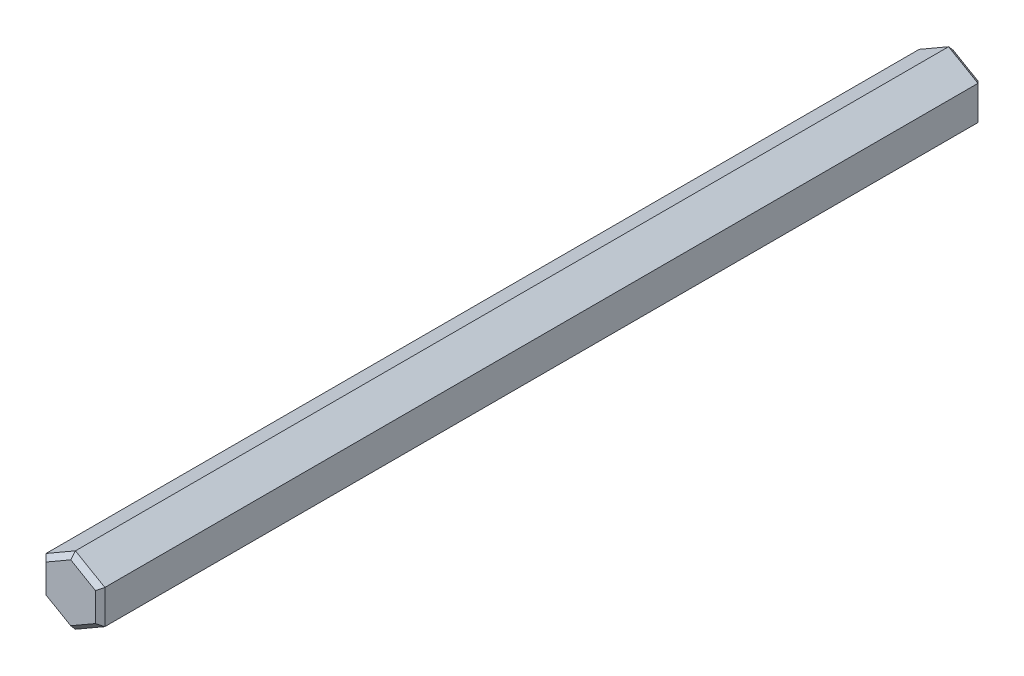
ISO-10303-21;
HEADER;
FILE_DESCRIPTION(('STEP AP214'),'2;1');
FILE_NAME('part.step','',(''),(''),'','','');
FILE_SCHEMA(('AUTOMOTIVE_DESIGN { 1 0 10303 214 1 1 1 1 }'));
ENDSEC;
DATA;
#1=APPLICATION_CONTEXT('core data for automotive mechanical design processes');
#2=APPLICATION_PROTOCOL_DEFINITION('international standard','automotive_design',2000,#1);
#3=PRODUCT_CONTEXT('',#1,'mechanical');
#4=PRODUCT('Part','Part','',(#3));
#5=PRODUCT_RELATED_PRODUCT_CATEGORY('part','',(#4));
#6=PRODUCT_DEFINITION_FORMATION('','',#4);
#7=PRODUCT_DEFINITION_CONTEXT('part definition',#1,'design');
#8=PRODUCT_DEFINITION('design','',#6,#7);
#9=PRODUCT_DEFINITION_SHAPE('','',#8);
#10=(LENGTH_UNIT() NAMED_UNIT(*) SI_UNIT(.MILLI.,.METRE.));
#11=(NAMED_UNIT(*) PLANE_ANGLE_UNIT() SI_UNIT($,.RADIAN.));
#12=(NAMED_UNIT(*) SI_UNIT($,.STERADIAN.) SOLID_ANGLE_UNIT());
#13=UNCERTAINTY_MEASURE_WITH_UNIT(LENGTH_MEASURE(1.E-05),#10,'distance_accuracy_value','');
#14=(GEOMETRIC_REPRESENTATION_CONTEXT(3) GLOBAL_UNCERTAINTY_ASSIGNED_CONTEXT((#13)) GLOBAL_UNIT_ASSIGNED_CONTEXT((#10,
#11,#12)) REPRESENTATION_CONTEXT('',''));
#15=CARTESIAN_POINT('',(0.,0.,0.));
#16=DIRECTION('',(0.,0.,1.));
#17=DIRECTION('',(1.,0.,0.));
#18=AXIS2_PLACEMENT_3D('',#15,#16,#17);
#19=CARTESIAN_POINT('',(-2.5,-1.44337567297406,0.));
#20=DIRECTION('',(-0.5,-0.866025403784439,0.));
#21=DIRECTION('',(0.866025403784439,-0.5,0.));
#22=AXIS2_PLACEMENT_3D('',#19,#20,#21);
#23=PLANE('',#22);
#24=DIRECTION('',(0.,0.,1.));
#25=VECTOR('',#24,1.);
#26=CARTESIAN_POINT('',(-2.5,-1.44337567297406,0.));
#27=LINE('',#26,#25);
#28=CARTESIAN_POINT('',(-2.5,-1.44337567297406,0.399999999999984));
#29=VERTEX_POINT('',#28);
#30=CARTESIAN_POINT('',(-2.5,-1.44337567297406,74.6));
#31=VERTEX_POINT('',#30);
#32=EDGE_CURVE('E149',#29,#31,#27,.T.);
#33=ORIENTED_EDGE('',*,*,#32,.F.);
#34=DIRECTION('',(0.866025403784439,-0.5,0.));
#35=VECTOR('',#34,1.);
#36=CARTESIAN_POINT('',(0.,-2.88675134594813,0.399999999999984));
#37=LINE('',#36,#35);
#38=CARTESIAN_POINT('',(0.,-2.88675134594813,0.399999999999984));
#39=VERTEX_POINT('',#38);
#40=EDGE_CURVE('E181',#29,#39,#37,.T.);
#41=ORIENTED_EDGE('',*,*,#40,.T.);
#42=DIRECTION('',(0.,0.,1.));
#43=VECTOR('',#42,1.);
#44=CARTESIAN_POINT('',(0.,-2.88675134594813,0.));
#45=LINE('',#44,#43);
#46=CARTESIAN_POINT('',(0.,-2.88675134594813,74.6));
#47=VERTEX_POINT('',#46);
#48=EDGE_CURVE('E214',#39,#47,#45,.T.);
#49=ORIENTED_EDGE('',*,*,#48,.T.);
#50=DIRECTION('',(-0.866025403784439,0.5,0.));
#51=VECTOR('',#50,1.);
#52=CARTESIAN_POINT('',(-2.5,-1.44337567297406,74.6));
#53=LINE('',#52,#51);
#54=EDGE_CURVE('E179',#47,#31,#53,.T.);
#55=ORIENTED_EDGE('',*,*,#54,.T.);
#56=EDGE_LOOP('',(#33,#41,#49,#55));
#57=FACE_BOUND('',#56,.T.);
#58=ADVANCED_FACE('F32',(#57),#23,.T.);
#59=CARTESIAN_POINT('',(-2.5,1.44337567297407,0.));
#60=DIRECTION('',(-1.,0.,0.));
#61=DIRECTION('',(0.,0.,1.));
#62=AXIS2_PLACEMENT_3D('',#59,#60,#61);
#63=PLANE('',#62);
#64=DIRECTION('',(0.,0.,1.));
#65=VECTOR('',#64,1.);
#66=CARTESIAN_POINT('',(-2.5,1.44337567297407,0.));
#67=LINE('',#66,#65);
#68=CARTESIAN_POINT('',(-2.5,1.44337567297407,0.399999999999984));
#69=VERTEX_POINT('',#68);
#70=CARTESIAN_POINT('',(-2.5,1.44337567297407,74.6));
#71=VERTEX_POINT('',#70);
#72=EDGE_CURVE('E130',#69,#71,#67,.T.);
#73=ORIENTED_EDGE('',*,*,#72,.F.);
#74=DIRECTION('',(0.,-1.,0.));
#75=VECTOR('',#74,1.);
#76=CARTESIAN_POINT('',(-2.5,-1.44337567297406,0.399999999999984));
#77=LINE('',#76,#75);
#78=EDGE_CURVE('E145',#69,#29,#77,.T.);
#79=ORIENTED_EDGE('',*,*,#78,.T.);
#80=ORIENTED_EDGE('',*,*,#32,.T.);
#81=DIRECTION('',(0.,1.,0.));
#82=VECTOR('',#81,1.);
#83=CARTESIAN_POINT('',(-2.5,1.44337567297407,74.6));
#84=LINE('',#83,#82);
#85=EDGE_CURVE('E148',#31,#71,#84,.T.);
#86=ORIENTED_EDGE('',*,*,#85,.T.);
#87=EDGE_LOOP('',(#73,#79,#80,#86));
#88=FACE_BOUND('',#87,.T.);
#89=ADVANCED_FACE('F142',(#88),#63,.T.);
#90=CARTESIAN_POINT('',(0.,2.88675134594813,0.));
#91=DIRECTION('',(-0.5,0.866025403784439,0.));
#92=DIRECTION('',(-0.866025403784439,-0.5,0.));
#93=AXIS2_PLACEMENT_3D('',#90,#91,#92);
#94=PLANE('',#93);
#95=DIRECTION('',(0.,0.,1.));
#96=VECTOR('',#95,1.);
#97=CARTESIAN_POINT('',(0.,2.88675134594813,0.));
#98=LINE('',#97,#96);
#99=CARTESIAN_POINT('',(0.,2.88675134594813,0.399999999999984));
#100=VERTEX_POINT('',#99);
#101=CARTESIAN_POINT('',(0.,2.88675134594813,74.6));
#102=VERTEX_POINT('',#101);
#103=EDGE_CURVE('E132',#100,#102,#98,.T.);
#104=ORIENTED_EDGE('',*,*,#103,.F.);
#105=DIRECTION('',(-0.866025403784439,-0.5,0.));
#106=VECTOR('',#105,1.);
#107=CARTESIAN_POINT('',(-2.5,1.44337567297407,0.399999999999984));
#108=LINE('',#107,#106);
#109=EDGE_CURVE('E126',#100,#69,#108,.T.);
#110=ORIENTED_EDGE('',*,*,#109,.T.);
#111=ORIENTED_EDGE('',*,*,#72,.T.);
#112=DIRECTION('',(0.866025403784439,0.5,0.));
#113=VECTOR('',#112,1.);
#114=CARTESIAN_POINT('',(0.,2.88675134594813,74.6));
#115=LINE('',#114,#113);
#116=EDGE_CURVE('E138',#71,#102,#115,.T.);
#117=ORIENTED_EDGE('',*,*,#116,.T.);
#118=EDGE_LOOP('',(#104,#110,#111,#117));
#119=FACE_BOUND('',#118,.T.);
#120=ADVANCED_FACE('F128',(#119),#94,.T.);
#121=CARTESIAN_POINT('',(2.5,1.44337567297406,0.));
#122=DIRECTION('',(0.5,0.866025403784439,0.));
#123=DIRECTION('',(-0.866025403784439,0.5,0.));
#124=AXIS2_PLACEMENT_3D('',#121,#122,#123);
#125=PLANE('',#124);
#126=DIRECTION('',(0.,0.,1.));
#127=VECTOR('',#126,1.);
#128=CARTESIAN_POINT('',(2.5,1.44337567297406,0.));
#129=LINE('',#128,#127);
#130=CARTESIAN_POINT('',(2.5,1.44337567297406,0.399999999999984));
#131=VERTEX_POINT('',#130);
#132=CARTESIAN_POINT('',(2.5,1.44337567297406,74.6));
#133=VERTEX_POINT('',#132);
#134=EDGE_CURVE('E248',#131,#133,#129,.T.);
#135=ORIENTED_EDGE('',*,*,#134,.F.);
#136=DIRECTION('',(-0.866025403784439,0.5,0.));
#137=VECTOR('',#136,1.);
#138=CARTESIAN_POINT('',(0.,2.88675134594813,0.399999999999984));
#139=LINE('',#138,#137);
#140=EDGE_CURVE('E189',#131,#100,#139,.T.);
#141=ORIENTED_EDGE('',*,*,#140,.T.);
#142=ORIENTED_EDGE('',*,*,#103,.T.);
#143=DIRECTION('',(0.866025403784439,-0.5,0.));
#144=VECTOR('',#143,1.);
#145=CARTESIAN_POINT('',(2.5,1.44337567297406,74.6));
#146=LINE('',#145,#144);
#147=EDGE_CURVE('E187',#102,#133,#146,.T.);
#148=ORIENTED_EDGE('',*,*,#147,.T.);
#149=EDGE_LOOP('',(#135,#141,#142,#148));
#150=FACE_BOUND('',#149,.T.);
#151=ADVANCED_FACE('F265',(#150),#125,.T.);
#152=CARTESIAN_POINT('',(2.5,-1.44337567297406,0.));
#153=DIRECTION('',(1.,0.,0.));
#154=DIRECTION('',(0.,0.,-1.));
#155=AXIS2_PLACEMENT_3D('',#152,#153,#154);
#156=PLANE('',#155);
#157=DIRECTION('',(0.,0.,1.));
#158=VECTOR('',#157,1.);
#159=CARTESIAN_POINT('',(2.5,-1.44337567297406,0.));
#160=LINE('',#159,#158);
#161=CARTESIAN_POINT('',(2.5,-1.44337567297406,0.399999999999984));
#162=VERTEX_POINT('',#161);
#163=CARTESIAN_POINT('',(2.5,-1.44337567297406,74.6));
#164=VERTEX_POINT('',#163);
#165=EDGE_CURVE('E246',#162,#164,#160,.T.);
#166=ORIENTED_EDGE('',*,*,#165,.F.);
#167=DIRECTION('',(0.,1.,0.));
#168=VECTOR('',#167,1.);
#169=CARTESIAN_POINT('',(2.5,1.44337567297406,0.399999999999984));
#170=LINE('',#169,#168);
#171=EDGE_CURVE('E193',#162,#131,#170,.T.);
#172=ORIENTED_EDGE('',*,*,#171,.T.);
#173=ORIENTED_EDGE('',*,*,#134,.T.);
#174=DIRECTION('',(0.,-1.,0.));
#175=VECTOR('',#174,1.);
#176=CARTESIAN_POINT('',(2.5,-1.44337567297406,74.6));
#177=LINE('',#176,#175);
#178=EDGE_CURVE('E191',#133,#164,#177,.T.);
#179=ORIENTED_EDGE('',*,*,#178,.T.);
#180=EDGE_LOOP('',(#166,#172,#173,#179));
#181=FACE_BOUND('',#180,.T.);
#182=ADVANCED_FACE('F302',(#181),#156,.T.);
#183=CARTESIAN_POINT('',(0.,-2.88675134594813,0.));
#184=DIRECTION('',(0.5,-0.866025403784439,0.));
#185=DIRECTION('',(0.866025403784439,0.5,0.));
#186=AXIS2_PLACEMENT_3D('',#183,#184,#185);
#187=PLANE('',#186);
#188=ORIENTED_EDGE('',*,*,#48,.F.);
#189=DIRECTION('',(0.866025403784439,0.5,0.));
#190=VECTOR('',#189,1.);
#191=CARTESIAN_POINT('',(2.5,-1.44337567297406,0.399999999999984));
#192=LINE('',#191,#190);
#193=EDGE_CURVE('E185',#39,#162,#192,.T.);
#194=ORIENTED_EDGE('',*,*,#193,.T.);
#195=ORIENTED_EDGE('',*,*,#165,.T.);
#196=DIRECTION('',(-0.866025403784439,-0.5,0.));
#197=VECTOR('',#196,1.);
#198=CARTESIAN_POINT('',(0.,-2.88675134594813,74.6));
#199=LINE('',#198,#197);
#200=EDGE_CURVE('E137',#164,#47,#199,.T.);
#201=ORIENTED_EDGE('',*,*,#200,.T.);
#202=EDGE_LOOP('',(#188,#194,#195,#201));
#203=FACE_BOUND('',#202,.T.);
#204=ADVANCED_FACE('F243',(#203),#187,.T.);
#205=CARTESIAN_POINT('',(0.,0.,0.));
#206=DIRECTION('',(0.,0.,1.));
#207=DIRECTION('',(1.,0.,0.));
#208=AXIS2_PLACEMENT_3D('',#205,#206,#207);
#209=PLANE('',#208);
#210=DIRECTION('',(-0.866025403784439,0.5,0.));
#211=VECTOR('',#210,1.);
#212=CARTESIAN_POINT('',(-2.3,-1.09696551146029,0.));
#213=LINE('',#212,#211);
#214=CARTESIAN_POINT('',(0.,-2.42487113059643,0.));
#215=VERTEX_POINT('',#214);
#216=CARTESIAN_POINT('',(-2.1,-1.21243556529822,0.));
#217=VERTEX_POINT('',#216);
#218=EDGE_CURVE('E175',#215,#217,#213,.T.);
#219=ORIENTED_EDGE('',*,*,#218,.T.);
#220=DIRECTION('',(0.,1.,0.));
#221=VECTOR('',#220,1.);
#222=CARTESIAN_POINT('',(-2.1,1.44337567297407,0.));
#223=LINE('',#222,#221);
#224=CARTESIAN_POINT('',(-2.1,1.21243556529822,0.));
#225=VERTEX_POINT('',#224);
#226=EDGE_CURVE('E177',#217,#225,#223,.T.);
#227=ORIENTED_EDGE('',*,*,#226,.T.);
#228=DIRECTION('',(0.866025403784439,0.5,0.));
#229=VECTOR('',#228,1.);
#230=CARTESIAN_POINT('',(0.199999999999997,2.54034118443435,0.));
#231=LINE('',#230,#229);
#232=CARTESIAN_POINT('',(0.,2.42487113059643,0.));
#233=VERTEX_POINT('',#232);
#234=EDGE_CURVE('E154',#225,#233,#231,.T.);
#235=ORIENTED_EDGE('',*,*,#234,.T.);
#236=DIRECTION('',(0.866025403784439,-0.5,0.));
#237=VECTOR('',#236,1.);
#238=CARTESIAN_POINT('',(2.3,1.09696551146029,0.));
#239=LINE('',#238,#237);
#240=CARTESIAN_POINT('',(2.1,1.21243556529821,0.));
#241=VERTEX_POINT('',#240);
#242=EDGE_CURVE('E166',#233,#241,#239,.T.);
#243=ORIENTED_EDGE('',*,*,#242,.T.);
#244=DIRECTION('',(0.,-1.,0.));
#245=VECTOR('',#244,1.);
#246=CARTESIAN_POINT('',(2.1,-1.44337567297406,0.));
#247=LINE('',#246,#245);
#248=CARTESIAN_POINT('',(2.1,-1.21243556529821,0.));
#249=VERTEX_POINT('',#248);
#250=EDGE_CURVE('E164',#241,#249,#247,.T.);
#251=ORIENTED_EDGE('',*,*,#250,.T.);
#252=DIRECTION('',(-0.866025403784439,-0.5,0.));
#253=VECTOR('',#252,1.);
#254=CARTESIAN_POINT('',(-0.199999999999999,-2.54034118443435,0.));
#255=LINE('',#254,#253);
#256=EDGE_CURVE('E172',#249,#215,#255,.T.);
#257=ORIENTED_EDGE('',*,*,#256,.T.);
#258=EDGE_LOOP('',(#219,#227,#235,#243,#251,#257));
#259=FACE_BOUND('',#258,.T.);
#260=ADVANCED_FACE('F273',(#259),#209,.F.);
#261=CARTESIAN_POINT('',(0.,0.,75.));
#262=DIRECTION('',(0.,0.,1.));
#263=DIRECTION('',(1.,0.,0.));
#264=AXIS2_PLACEMENT_3D('',#261,#262,#263);
#265=PLANE('',#264);
#266=DIRECTION('',(-0.866025403784439,0.5,0.));
#267=VECTOR('',#266,1.);
#268=CARTESIAN_POINT('',(1.05,1.81865334794732,75.));
#269=LINE('',#268,#267);
#270=CARTESIAN_POINT('',(2.1,1.21243556529821,75.));
#271=VERTEX_POINT('',#270);
#272=CARTESIAN_POINT('',(0.,2.42487113059643,75.));
#273=VERTEX_POINT('',#272);
#274=EDGE_CURVE('E56',#271,#273,#269,.T.);
#275=ORIENTED_EDGE('',*,*,#274,.T.);
#276=DIRECTION('',(-0.866025403784439,-0.5,0.));
#277=VECTOR('',#276,1.);
#278=CARTESIAN_POINT('',(-1.05,1.81865334794732,75.));
#279=LINE('',#278,#277);
#280=CARTESIAN_POINT('',(-2.1,1.21243556529822,75.));
#281=VERTEX_POINT('',#280);
#282=EDGE_CURVE('E11',#273,#281,#279,.T.);
#283=ORIENTED_EDGE('',*,*,#282,.T.);
#284=DIRECTION('',(0.,-1.,0.));
#285=VECTOR('',#284,1.);
#286=CARTESIAN_POINT('',(-2.1,0.,75.));
#287=LINE('',#286,#285);
#288=CARTESIAN_POINT('',(-2.1,-1.21243556529821,75.));
#289=VERTEX_POINT('',#288);
#290=EDGE_CURVE('E41',#281,#289,#287,.T.);
#291=ORIENTED_EDGE('',*,*,#290,.T.);
#292=DIRECTION('',(0.866025403784439,-0.5,0.));
#293=VECTOR('',#292,1.);
#294=CARTESIAN_POINT('',(-1.05,-1.81865334794732,75.));
#295=LINE('',#294,#293);
#296=CARTESIAN_POINT('',(0.,-2.42487113059643,75.));
#297=VERTEX_POINT('',#296);
#298=EDGE_CURVE('E199',#289,#297,#295,.T.);
#299=ORIENTED_EDGE('',*,*,#298,.T.);
#300=DIRECTION('',(0.866025403784439,0.5,0.));
#301=VECTOR('',#300,1.);
#302=CARTESIAN_POINT('',(1.05,-1.81865334794732,75.));
#303=LINE('',#302,#301);
#304=CARTESIAN_POINT('',(2.1,-1.21243556529821,75.));
#305=VERTEX_POINT('',#304);
#306=EDGE_CURVE('E195',#297,#305,#303,.T.);
#307=ORIENTED_EDGE('',*,*,#306,.T.);
#308=DIRECTION('',(0.,1.,0.));
#309=VECTOR('',#308,1.);
#310=CARTESIAN_POINT('',(2.1,0.,75.));
#311=LINE('',#310,#309);
#312=EDGE_CURVE('E197',#305,#271,#311,.T.);
#313=ORIENTED_EDGE('',*,*,#312,.T.);
#314=EDGE_LOOP('',(#275,#283,#291,#299,#307,#313));
#315=FACE_BOUND('',#314,.T.);
#316=ADVANCED_FACE('F258',(#315),#265,.T.);
#317=CARTESIAN_POINT('',(2.5,-1.44337567297406,0.399999999999984));
#318=DIRECTION('',(0.707106781186548,0.,-0.707106781186548));
#319=DIRECTION('',(0.,-1.,0.));
#320=AXIS2_PLACEMENT_3D('',#317,#318,#319);
#321=PLANE('',#320);
#322=DIRECTION('',(-0.654653670707977,0.377964473009227,-0.654653670707977));
#323=VECTOR('',#322,1.);
#324=CARTESIAN_POINT('',(2.5,-1.44337567297406,0.399999999999984));
#325=LINE('',#324,#323);
#326=EDGE_CURVE('E208',#249,#162,#325,.F.);
#327=ORIENTED_EDGE('',*,*,#326,.F.);
#328=ORIENTED_EDGE('',*,*,#250,.F.);
#329=DIRECTION('',(0.654653670707977,0.377964473009227,0.654653670707977));
#330=VECTOR('',#329,1.);
#331=CARTESIAN_POINT('',(1.78571428571428,1.0309826235529,-0.31428571428573));
#332=LINE('',#331,#330);
#333=EDGE_CURVE('E211',#131,#241,#332,.F.);
#334=ORIENTED_EDGE('',*,*,#333,.F.);
#335=ORIENTED_EDGE('',*,*,#171,.F.);
#336=EDGE_LOOP('',(#327,#328,#334,#335));
#337=FACE_BOUND('',#336,.T.);
#338=ADVANCED_FACE('F276',(#337),#321,.T.);
#339=CARTESIAN_POINT('',(2.5,1.44337567297406,0.399999999999984));
#340=DIRECTION('',(0.353553390593274,0.612372435695795,-0.707106781186547));
#341=DIRECTION('',(0.866025403784439,-0.5,0.));
#342=AXIS2_PLACEMENT_3D('',#339,#340,#341);
#343=PLANE('',#342);
#344=ORIENTED_EDGE('',*,*,#333,.T.);
#345=ORIENTED_EDGE('',*,*,#242,.F.);
#346=DIRECTION('',(0.,0.755928946018454,0.654653670707977));
#347=VECTOR('',#346,1.);
#348=CARTESIAN_POINT('',(0.,2.0619652471058,-0.314285714285731));
#349=LINE('',#348,#347);
#350=EDGE_CURVE('E206',#100,#233,#349,.F.);
#351=ORIENTED_EDGE('',*,*,#350,.F.);
#352=ORIENTED_EDGE('',*,*,#140,.F.);
#353=EDGE_LOOP('',(#344,#345,#351,#352));
#354=FACE_BOUND('',#353,.T.);
#355=ADVANCED_FACE('F269',(#354),#343,.T.);
#356=CARTESIAN_POINT('',(0.,-2.88675134594813,0.399999999999984));
#357=DIRECTION('',(0.353553390593274,-0.612372435695795,-0.707106781186547));
#358=DIRECTION('',(-0.866025403784439,-0.5,0.));
#359=AXIS2_PLACEMENT_3D('',#356,#357,#358);
#360=PLANE('',#359);
#361=ORIENTED_EDGE('',*,*,#326,.T.);
#362=ORIENTED_EDGE('',*,*,#193,.F.);
#363=DIRECTION('',(0.,0.755928946018454,-0.654653670707977));
#364=VECTOR('',#363,1.);
#365=CARTESIAN_POINT('',(0.,-2.88675134594813,0.399999999999984));
#366=LINE('',#365,#364);
#367=EDGE_CURVE('E158',#215,#39,#366,.F.);
#368=ORIENTED_EDGE('',*,*,#367,.F.);
#369=ORIENTED_EDGE('',*,*,#256,.F.);
#370=EDGE_LOOP('',(#361,#362,#368,#369));
#371=FACE_BOUND('',#370,.T.);
#372=ADVANCED_FACE('F281',(#371),#360,.T.);
#373=CARTESIAN_POINT('',(0.,2.88675134594813,0.399999999999984));
#374=DIRECTION('',(-0.353553390593274,0.612372435695794,-0.707106781186548));
#375=DIRECTION('',(0.866025403784439,0.5,0.));
#376=AXIS2_PLACEMENT_3D('',#373,#374,#375);
#377=PLANE('',#376);
#378=ORIENTED_EDGE('',*,*,#350,.T.);
#379=ORIENTED_EDGE('',*,*,#234,.F.);
#380=DIRECTION('',(-0.654653670707977,0.377964473009227,0.654653670707977));
#381=VECTOR('',#380,1.);
#382=CARTESIAN_POINT('',(-1.78571428571429,1.0309826235529,-0.31428571428573));
#383=LINE('',#382,#381);
#384=EDGE_CURVE('E152',#69,#225,#383,.F.);
#385=ORIENTED_EDGE('',*,*,#384,.F.);
#386=ORIENTED_EDGE('',*,*,#109,.F.);
#387=EDGE_LOOP('',(#378,#379,#385,#386));
#388=FACE_BOUND('',#387,.T.);
#389=ADVANCED_FACE('F153',(#388),#377,.T.);
#390=CARTESIAN_POINT('',(-2.5,-1.44337567297406,0.399999999999984));
#391=DIRECTION('',(-0.353553390593274,-0.612372435695795,-0.707106781186547));
#392=DIRECTION('',(-0.866025403784439,0.5,0.));
#393=AXIS2_PLACEMENT_3D('',#390,#391,#392);
#394=PLANE('',#393);
#395=ORIENTED_EDGE('',*,*,#367,.T.);
#396=ORIENTED_EDGE('',*,*,#40,.F.);
#397=DIRECTION('',(0.654653670707977,0.377964473009227,-0.654653670707977));
#398=VECTOR('',#397,1.);
#399=CARTESIAN_POINT('',(-2.5,-1.44337567297406,0.399999999999984));
#400=LINE('',#399,#398);
#401=EDGE_CURVE('E159',#217,#29,#400,.F.);
#402=ORIENTED_EDGE('',*,*,#401,.F.);
#403=ORIENTED_EDGE('',*,*,#218,.F.);
#404=EDGE_LOOP('',(#395,#396,#402,#403));
#405=FACE_BOUND('',#404,.T.);
#406=ADVANCED_FACE('F284',(#405),#394,.T.);
#407=CARTESIAN_POINT('',(-2.5,1.44337567297407,0.399999999999984));
#408=DIRECTION('',(-0.707106781186548,0.,-0.707106781186548));
#409=DIRECTION('',(0.,1.,0.));
#410=AXIS2_PLACEMENT_3D('',#407,#408,#409);
#411=PLANE('',#410);
#412=ORIENTED_EDGE('',*,*,#384,.T.);
#413=ORIENTED_EDGE('',*,*,#226,.F.);
#414=ORIENTED_EDGE('',*,*,#401,.T.);
#415=ORIENTED_EDGE('',*,*,#78,.F.);
#416=EDGE_LOOP('',(#412,#413,#414,#415));
#417=FACE_BOUND('',#416,.T.);
#418=ADVANCED_FACE('F161',(#417),#411,.T.);
#419=CARTESIAN_POINT('',(1.05,-1.81865334794732,75.));
#420=DIRECTION('',(-0.353553390593279,0.612372435695804,-0.707106781186536));
#421=DIRECTION('',(0.866025403784439,0.5,0.));
#422=AXIS2_PLACEMENT_3D('',#419,#420,#421);
#423=PLANE('',#422);
#424=DIRECTION('',(0.,-0.755928946018444,-0.654653670707989));
#425=VECTOR('',#424,1.);
#426=CARTESIAN_POINT('',(0.,-2.07846096908266,75.3));
#427=LINE('',#426,#425);
#428=EDGE_CURVE('E223',#47,#297,#427,.F.);
#429=ORIENTED_EDGE('',*,*,#428,.F.);
#430=ORIENTED_EDGE('',*,*,#200,.F.);
#431=DIRECTION('',(-0.654653670707968,0.377964473009222,0.654653670707989));
#432=VECTOR('',#431,1.);
#433=CARTESIAN_POINT('',(1.80000000000001,-1.03923048454133,75.3));
#434=LINE('',#433,#432);
#435=EDGE_CURVE('E36',#305,#164,#434,.F.);
#436=ORIENTED_EDGE('',*,*,#435,.F.);
#437=ORIENTED_EDGE('',*,*,#306,.F.);
#438=EDGE_LOOP('',(#429,#430,#436,#437));
#439=FACE_BOUND('',#438,.T.);
#440=ADVANCED_FACE('F34',(#439),#423,.F.);
#441=CARTESIAN_POINT('',(2.1,0.,75.));
#442=DIRECTION('',(-0.707106781186559,0.,-0.707106781186536));
#443=DIRECTION('',(0.,1.,0.));
#444=AXIS2_PLACEMENT_3D('',#441,#442,#443);
#445=PLANE('',#444);
#446=ORIENTED_EDGE('',*,*,#435,.T.);
#447=ORIENTED_EDGE('',*,*,#178,.F.);
#448=DIRECTION('',(-0.654653670707968,-0.377964473009223,0.654653670707989));
#449=VECTOR('',#448,1.);
#450=CARTESIAN_POINT('',(1.80000000000001,1.03923048454133,75.3));
#451=LINE('',#450,#449);
#452=EDGE_CURVE('E221',#271,#133,#451,.F.);
#453=ORIENTED_EDGE('',*,*,#452,.F.);
#454=ORIENTED_EDGE('',*,*,#312,.F.);
#455=EDGE_LOOP('',(#446,#447,#453,#454));
#456=FACE_BOUND('',#455,.T.);
#457=ADVANCED_FACE('F234',(#456),#445,.F.);
#458=CARTESIAN_POINT('',(-1.05,-1.81865334794732,75.));
#459=DIRECTION('',(0.353553390593279,0.612372435695804,-0.707106781186537));
#460=DIRECTION('',(0.866025403784439,-0.5,0.));
#461=AXIS2_PLACEMENT_3D('',#458,#459,#460);
#462=PLANE('',#461);
#463=ORIENTED_EDGE('',*,*,#428,.T.);
#464=ORIENTED_EDGE('',*,*,#298,.F.);
#465=DIRECTION('',(-0.654653670707968,-0.377964473009223,-0.654653670707989));
#466=VECTOR('',#465,1.);
#467=CARTESIAN_POINT('',(-1.80000000000001,-1.03923048454133,75.3));
#468=LINE('',#467,#466);
#469=EDGE_CURVE('E218',#31,#289,#468,.F.);
#470=ORIENTED_EDGE('',*,*,#469,.F.);
#471=ORIENTED_EDGE('',*,*,#54,.F.);
#472=EDGE_LOOP('',(#463,#464,#470,#471));
#473=FACE_BOUND('',#472,.T.);
#474=ADVANCED_FACE('F255',(#473),#462,.F.);
#475=CARTESIAN_POINT('',(1.05,1.81865334794732,75.));
#476=DIRECTION('',(-0.353553390593279,-0.612372435695804,-0.707106781186537));
#477=DIRECTION('',(-0.866025403784439,0.5,0.));
#478=AXIS2_PLACEMENT_3D('',#475,#476,#477);
#479=PLANE('',#478);
#480=ORIENTED_EDGE('',*,*,#452,.T.);
#481=ORIENTED_EDGE('',*,*,#147,.F.);
#482=DIRECTION('',(0.,-0.755928946018445,0.654653670707989));
#483=VECTOR('',#482,1.);
#484=CARTESIAN_POINT('',(0.,2.07846096908266,75.3));
#485=LINE('',#484,#483);
#486=EDGE_CURVE('E216',#273,#102,#485,.F.);
#487=ORIENTED_EDGE('',*,*,#486,.F.);
#488=ORIENTED_EDGE('',*,*,#274,.F.);
#489=EDGE_LOOP('',(#480,#481,#487,#488));
#490=FACE_BOUND('',#489,.T.);
#491=ADVANCED_FACE('F262',(#490),#479,.F.);
#492=CARTESIAN_POINT('',(-2.1,0.,75.));
#493=DIRECTION('',(0.707106781186559,0.,-0.707106781186536));
#494=DIRECTION('',(0.,-1.,0.));
#495=AXIS2_PLACEMENT_3D('',#492,#493,#494);
#496=PLANE('',#495);
#497=ORIENTED_EDGE('',*,*,#469,.T.);
#498=ORIENTED_EDGE('',*,*,#290,.F.);
#499=DIRECTION('',(-0.654653670707968,0.377964473009222,-0.654653670707989));
#500=VECTOR('',#499,1.);
#501=CARTESIAN_POINT('',(-1.80000000000001,1.03923048454133,75.3));
#502=LINE('',#501,#500);
#503=EDGE_CURVE('E49',#71,#281,#502,.F.);
#504=ORIENTED_EDGE('',*,*,#503,.F.);
#505=ORIENTED_EDGE('',*,*,#85,.F.);
#506=EDGE_LOOP('',(#497,#498,#504,#505));
#507=FACE_BOUND('',#506,.T.);
#508=ADVANCED_FACE('F257',(#507),#496,.F.);
#509=CARTESIAN_POINT('',(-1.05,1.81865334794732,75.));
#510=DIRECTION('',(0.353553390593279,-0.612372435695804,-0.707106781186537));
#511=DIRECTION('',(-0.866025403784439,-0.5,0.));
#512=AXIS2_PLACEMENT_3D('',#509,#510,#511);
#513=PLANE('',#512);
#514=ORIENTED_EDGE('',*,*,#486,.T.);
#515=ORIENTED_EDGE('',*,*,#116,.F.);
#516=ORIENTED_EDGE('',*,*,#503,.T.);
#517=ORIENTED_EDGE('',*,*,#282,.F.);
#518=EDGE_LOOP('',(#514,#515,#516,#517));
#519=FACE_BOUND('',#518,.T.);
#520=ADVANCED_FACE('F259',(#519),#513,.F.);
#521=CLOSED_SHELL('',(#58,#89,#120,#151,#182,#204,#260,#316,#338,#355,#372,#389,#406,#418,#440,
#457,#474,#491,#508,#520));
#522=MANIFOLD_SOLID_BREP('B2',#521);
#523=ADVANCED_BREP_SHAPE_REPRESENTATION('',(#18,#522),#14);
#524=SHAPE_DEFINITION_REPRESENTATION(#9,#523);
ENDSEC;
END-ISO-10303-21;
